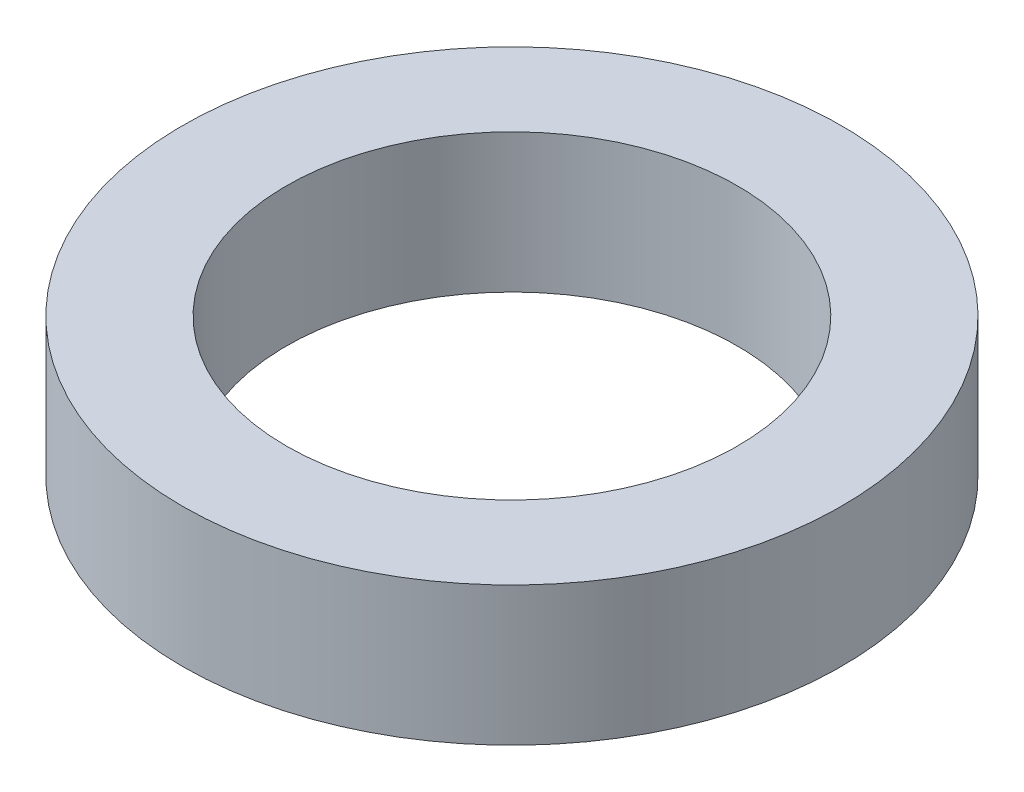
ISO-10303-21;
HEADER;
FILE_DESCRIPTION(('STEP AP214'),'2;1');
FILE_NAME('part.step','',(''),(''),'','','');
FILE_SCHEMA(('AUTOMOTIVE_DESIGN { 1 0 10303 214 1 1 1 1 }'));
ENDSEC;
DATA;
#1=APPLICATION_CONTEXT('core data for automotive mechanical design processes');
#2=APPLICATION_PROTOCOL_DEFINITION('international standard','automotive_design',2000,#1);
#3=PRODUCT_CONTEXT('',#1,'mechanical');
#4=PRODUCT('Part','Part','',(#3));
#5=PRODUCT_RELATED_PRODUCT_CATEGORY('part','',(#4));
#6=PRODUCT_DEFINITION_FORMATION('','',#4);
#7=PRODUCT_DEFINITION_CONTEXT('part definition',#1,'design');
#8=PRODUCT_DEFINITION('design','',#6,#7);
#9=PRODUCT_DEFINITION_SHAPE('','',#8);
#10=(LENGTH_UNIT() NAMED_UNIT(*) SI_UNIT(.MILLI.,.METRE.));
#11=(NAMED_UNIT(*) PLANE_ANGLE_UNIT() SI_UNIT($,.RADIAN.));
#12=(NAMED_UNIT(*) SI_UNIT($,.STERADIAN.) SOLID_ANGLE_UNIT());
#13=UNCERTAINTY_MEASURE_WITH_UNIT(LENGTH_MEASURE(1.E-05),#10,'distance_accuracy_value','');
#14=(GEOMETRIC_REPRESENTATION_CONTEXT(3) GLOBAL_UNCERTAINTY_ASSIGNED_CONTEXT((#13)) GLOBAL_UNIT_ASSIGNED_CONTEXT((#10,
#11,#12)) REPRESENTATION_CONTEXT('',''));
#15=CARTESIAN_POINT('',(0.,0.,0.));
#16=DIRECTION('',(0.,0.,1.));
#17=DIRECTION('',(1.,0.,0.));
#18=AXIS2_PLACEMENT_3D('',#15,#16,#17);
#19=CARTESIAN_POINT('',(0.,20.,0.));
#20=DIRECTION('',(0.,-1.,0.));
#21=DIRECTION('',(0.,0.,-1.));
#22=AXIS2_PLACEMENT_3D('',#19,#20,#21);
#23=CYLINDRICAL_SURFACE('',#22,47.5);
#24=CARTESIAN_POINT('',(0.,20.,0.));
#25=DIRECTION('',(0.,1.,0.));
#26=DIRECTION('',(0.,0.,1.));
#27=AXIS2_PLACEMENT_3D('',#24,#25,#26);
#28=CIRCLE('',#27,47.5);
#29=CARTESIAN_POINT('',(0.,20.,47.5));
#30=VERTEX_POINT('',#29);
#31=EDGE_CURVE('E10',#30,#30,#28,.T.);
#32=ORIENTED_EDGE('',*,*,#31,.F.);
#33=EDGE_LOOP('',(#32));
#34=FACE_BOUND('',#33,.T.);
#35=CARTESIAN_POINT('',(0.,0.,0.));
#36=DIRECTION('',(0.,1.,0.));
#37=DIRECTION('',(0.,0.,1.));
#38=AXIS2_PLACEMENT_3D('',#35,#36,#37);
#39=CIRCLE('',#38,47.5);
#40=CARTESIAN_POINT('',(0.,0.,47.5));
#41=VERTEX_POINT('',#40);
#42=EDGE_CURVE('E37',#41,#41,#39,.T.);
#43=ORIENTED_EDGE('',*,*,#42,.T.);
#44=EDGE_LOOP('',(#43));
#45=FACE_BOUND('',#44,.T.);
#46=ADVANCED_FACE('F40',(#34,#45),#23,.T.);
#47=CARTESIAN_POINT('',(0.,20.,0.));
#48=DIRECTION('',(0.,1.,0.));
#49=DIRECTION('',(0.,0.,1.));
#50=AXIS2_PLACEMENT_3D('',#47,#48,#49);
#51=PLANE('',#50);
#52=CARTESIAN_POINT('',(0.,20.,0.));
#53=DIRECTION('',(0.,1.,0.));
#54=DIRECTION('',(0.,0.,1.));
#55=AXIS2_PLACEMENT_3D('',#52,#53,#54);
#56=CIRCLE('',#55,32.5);
#57=CARTESIAN_POINT('',(0.,20.,32.5));
#58=VERTEX_POINT('',#57);
#59=EDGE_CURVE('E50',#58,#58,#56,.T.);
#60=ORIENTED_EDGE('',*,*,#59,.F.);
#61=EDGE_LOOP('',(#60));
#62=FACE_BOUND('',#61,.T.);
#63=ORIENTED_EDGE('',*,*,#31,.T.);
#64=EDGE_LOOP('',(#63));
#65=FACE_BOUND('',#64,.T.);
#66=ADVANCED_FACE('F59',(#62,#65),#51,.T.);
#67=CARTESIAN_POINT('',(0.,0.,0.));
#68=DIRECTION('',(0.,1.,0.));
#69=DIRECTION('',(0.,0.,1.));
#70=AXIS2_PLACEMENT_3D('',#67,#68,#69);
#71=PLANE('',#70);
#72=CARTESIAN_POINT('',(0.,0.,0.));
#73=DIRECTION('',(0.,1.,0.));
#74=DIRECTION('',(0.,0.,1.));
#75=AXIS2_PLACEMENT_3D('',#72,#73,#74);
#76=CIRCLE('',#75,32.5);
#77=CARTESIAN_POINT('',(0.,0.,32.5));
#78=VERTEX_POINT('',#77);
#79=EDGE_CURVE('E47',#78,#78,#76,.T.);
#80=ORIENTED_EDGE('',*,*,#79,.T.);
#81=EDGE_LOOP('',(#80));
#82=FACE_BOUND('',#81,.T.);
#83=ORIENTED_EDGE('',*,*,#42,.F.);
#84=EDGE_LOOP('',(#83));
#85=FACE_BOUND('',#84,.T.);
#86=ADVANCED_FACE('F58',(#82,#85),#71,.F.);
#87=CARTESIAN_POINT('',(0.,20.,0.));
#88=DIRECTION('',(0.,-1.,0.));
#89=DIRECTION('',(0.,0.,-1.));
#90=AXIS2_PLACEMENT_3D('',#87,#88,#89);
#91=CYLINDRICAL_SURFACE('',#90,32.5);
#92=ORIENTED_EDGE('',*,*,#59,.T.);
#93=EDGE_LOOP('',(#92));
#94=FACE_BOUND('',#93,.T.);
#95=ORIENTED_EDGE('',*,*,#79,.F.);
#96=EDGE_LOOP('',(#95));
#97=FACE_BOUND('',#96,.T.);
#98=ADVANCED_FACE('F54',(#94,#97),#91,.F.);
#99=CLOSED_SHELL('',(#46,#66,#86,#98));
#100=MANIFOLD_SOLID_BREP('B2',#99);
#101=ADVANCED_BREP_SHAPE_REPRESENTATION('',(#18,#100),#14);
#102=SHAPE_DEFINITION_REPRESENTATION(#9,#101);
ENDSEC;
END-ISO-10303-21;
